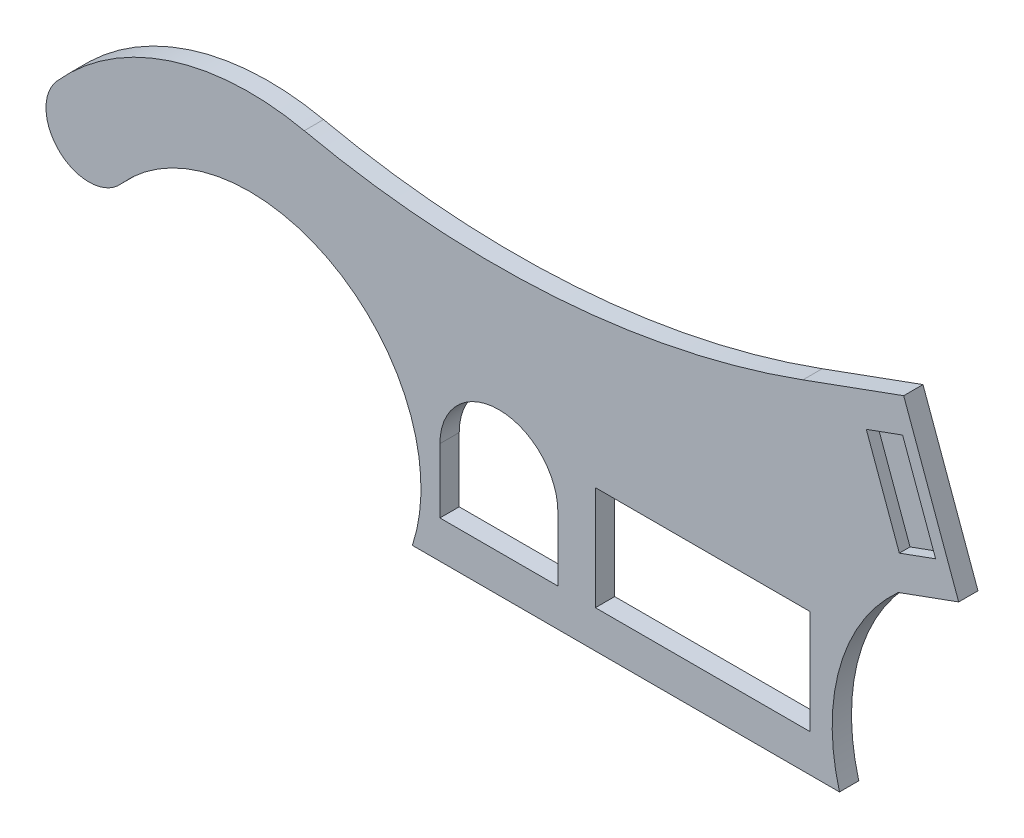
ISO-10303-21;
HEADER;
FILE_DESCRIPTION(('STEP AP214'),'2;1');
FILE_NAME('part.step','',(''),(''),'','','');
FILE_SCHEMA(('AUTOMOTIVE_DESIGN { 1 0 10303 214 1 1 1 1 }'));
ENDSEC;
DATA;
#1=APPLICATION_CONTEXT('core data for automotive mechanical design processes');
#2=APPLICATION_PROTOCOL_DEFINITION('international standard','automotive_design',2000,#1);
#3=PRODUCT_CONTEXT('',#1,'mechanical');
#4=PRODUCT('Part','Part','',(#3));
#5=PRODUCT_RELATED_PRODUCT_CATEGORY('part','',(#4));
#6=PRODUCT_DEFINITION_FORMATION('','',#4);
#7=PRODUCT_DEFINITION_CONTEXT('part definition',#1,'design');
#8=PRODUCT_DEFINITION('design','',#6,#7);
#9=PRODUCT_DEFINITION_SHAPE('','',#8);
#10=(LENGTH_UNIT() NAMED_UNIT(*) SI_UNIT(.MILLI.,.METRE.));
#11=(NAMED_UNIT(*) PLANE_ANGLE_UNIT() SI_UNIT($,.RADIAN.));
#12=(NAMED_UNIT(*) SI_UNIT($,.STERADIAN.) SOLID_ANGLE_UNIT());
#13=UNCERTAINTY_MEASURE_WITH_UNIT(LENGTH_MEASURE(1.E-05),#10,'distance_accuracy_value','');
#14=(GEOMETRIC_REPRESENTATION_CONTEXT(3) GLOBAL_UNCERTAINTY_ASSIGNED_CONTEXT((#13)) GLOBAL_UNIT_ASSIGNED_CONTEXT((#10,
#11,#12)) REPRESENTATION_CONTEXT('',''));
#15=CARTESIAN_POINT('',(0.,0.,0.));
#16=DIRECTION('',(0.,0.,1.));
#17=DIRECTION('',(1.,0.,0.));
#18=AXIS2_PLACEMENT_3D('',#15,#16,#17);
#19=CARTESIAN_POINT('',(0.,0.,18.));
#20=DIRECTION('',(0.342020143325666,-0.939692620785909,0.));
#21=DIRECTION('',(0.93969262078591,0.342020143325666,0.));
#22=AXIS2_PLACEMENT_3D('',#19,#20,#21);
#23=PLANE('',#22);
#24=DIRECTION('',(-0.939692620785909,-0.342020143325666,0.));
#25=VECTOR('',#24,1.);
#26=CARTESIAN_POINT('',(0.,0.,0.));
#27=LINE('',#26,#25);
#28=CARTESIAN_POINT('',(0.,0.,0.));
#29=VERTEX_POINT('',#28);
#30=CARTESIAN_POINT('',(-93.9692620785907,-34.2020143325665,0.));
#31=VERTEX_POINT('',#30);
#32=EDGE_CURVE('E242',#29,#31,#27,.T.);
#33=ORIENTED_EDGE('',*,*,#32,.T.);
#34=DIRECTION('',(0.,0.,-1.));
#35=VECTOR('',#34,1.);
#36=CARTESIAN_POINT('',(-93.9692620785907,-34.2020143325665,18.));
#37=LINE('',#36,#35);
#38=CARTESIAN_POINT('',(-93.9692620785907,-34.2020143325665,18.));
#39=VERTEX_POINT('',#38);
#40=EDGE_CURVE('E11',#39,#31,#37,.T.);
#41=ORIENTED_EDGE('',*,*,#40,.F.);
#42=DIRECTION('',(-0.939692620785909,-0.342020143325666,0.));
#43=VECTOR('',#42,1.);
#44=CARTESIAN_POINT('',(0.,0.,18.));
#45=LINE('',#44,#43);
#46=CARTESIAN_POINT('',(0.,0.,18.));
#47=VERTEX_POINT('',#46);
#48=EDGE_CURVE('E278',#47,#39,#45,.T.);
#49=ORIENTED_EDGE('',*,*,#48,.F.);
#50=DIRECTION('',(0.,0.,-1.));
#51=VECTOR('',#50,1.);
#52=CARTESIAN_POINT('',(0.,0.,18.));
#53=LINE('',#52,#51);
#54=EDGE_CURVE('E298',#47,#29,#53,.T.);
#55=ORIENTED_EDGE('',*,*,#54,.T.);
#56=EDGE_LOOP('',(#33,#41,#49,#55));
#57=FACE_BOUND('',#56,.T.);
#58=ADVANCED_FACE('F35',(#57),#23,.F.);
#59=CARTESIAN_POINT('',(-380.564455781356,753.21180889001,18.));
#60=DIRECTION('',(0.,0.,-1.));
#61=DIRECTION('',(-1.,0.,0.));
#62=AXIS2_PLACEMENT_3D('',#59,#60,#61);
#63=CYLINDRICAL_SURFACE('',#62,837.948288413742);
#64=CARTESIAN_POINT('',(-380.564455781356,753.21180889001,0.));
#65=DIRECTION('',(0.,0.,-1.));
#66=DIRECTION('',(1.,0.,0.));
#67=AXIS2_PLACEMENT_3D('',#64,#65,#66);
#68=CIRCLE('',#67,837.948288413742);
#69=CARTESIAN_POINT('',(-559.0472163884,-65.5074581494367,0.));
#70=VERTEX_POINT('',#69);
#71=EDGE_CURVE('E301',#31,#70,#68,.T.);
#72=ORIENTED_EDGE('',*,*,#71,.T.);
#73=DIRECTION('',(0.,0.,-1.));
#74=VECTOR('',#73,1.);
#75=CARTESIAN_POINT('',(-559.0472163884,-65.5074581494367,18.));
#76=LINE('',#75,#74);
#77=CARTESIAN_POINT('',(-559.0472163884,-65.5074581494367,18.));
#78=VERTEX_POINT('',#77);
#79=EDGE_CURVE('E42',#78,#70,#76,.T.);
#80=ORIENTED_EDGE('',*,*,#79,.F.);
#81=CARTESIAN_POINT('',(-380.564455781356,753.21180889001,18.));
#82=DIRECTION('',(0.,0.,-1.));
#83=DIRECTION('',(1.,0.,0.));
#84=AXIS2_PLACEMENT_3D('',#81,#82,#83);
#85=CIRCLE('',#84,837.948288413742);
#86=EDGE_CURVE('E281',#39,#78,#85,.T.);
#87=ORIENTED_EDGE('',*,*,#86,.F.);
#88=ORIENTED_EDGE('',*,*,#40,.T.);
#89=EDGE_LOOP('',(#72,#80,#87,#88));
#90=FACE_BOUND('',#89,.T.);
#91=ADVANCED_FACE('F363',(#90),#63,.F.);
#92=CARTESIAN_POINT('',(-610.167151995381,-300.,18.));
#93=DIRECTION('',(0.,0.,-1.));
#94=DIRECTION('',(-1.,0.,0.));
#95=AXIS2_PLACEMENT_3D('',#92,#93,#94);
#96=CYLINDRICAL_SURFACE('',#95,240.);
#97=CARTESIAN_POINT('',(-610.167151995381,-300.,0.));
#98=DIRECTION('',(0.,0.,1.));
#99=DIRECTION('',(-1.,0.,0.));
#100=AXIS2_PLACEMENT_3D('',#97,#98,#99);
#101=CIRCLE('',#100,240.);
#102=CARTESIAN_POINT('',(-789.821657990136,-140.864025199264,0.));
#103=VERTEX_POINT('',#102);
#104=EDGE_CURVE('E303',#70,#103,#101,.T.);
#105=ORIENTED_EDGE('',*,*,#104,.T.);
#106=DIRECTION('',(0.,0.,-1.));
#107=VECTOR('',#106,1.);
#108=CARTESIAN_POINT('',(-789.821657990136,-140.864025199264,18.));
#109=LINE('',#108,#107);
#110=CARTESIAN_POINT('',(-789.821657990136,-140.864025199264,18.));
#111=VERTEX_POINT('',#110);
#112=EDGE_CURVE('E333',#111,#103,#109,.T.);
#113=ORIENTED_EDGE('',*,*,#112,.F.);
#114=CARTESIAN_POINT('',(-610.167151995381,-300.,18.));
#115=DIRECTION('',(0.,0.,1.));
#116=DIRECTION('',(-1.,0.,0.));
#117=AXIS2_PLACEMENT_3D('',#114,#115,#116);
#118=CIRCLE('',#117,240.);
#119=EDGE_CURVE('E284',#78,#111,#118,.T.);
#120=ORIENTED_EDGE('',*,*,#119,.F.);
#121=ORIENTED_EDGE('',*,*,#79,.T.);
#122=EDGE_LOOP('',(#105,#113,#120,#121));
#123=FACE_BOUND('',#122,.T.);
#124=ADVANCED_FACE('F340',(#123),#96,.T.);
#125=CARTESIAN_POINT('',(-759.879240324344,-167.386687666053,18.));
#126=DIRECTION('',(0.,0.,-1.));
#127=DIRECTION('',(-1.,0.,0.));
#128=AXIS2_PLACEMENT_3D('',#125,#126,#127);
#129=CYLINDRICAL_SURFACE('',#128,40.);
#130=CARTESIAN_POINT('',(-759.879240324344,-167.386687666053,0.));
#131=DIRECTION('',(0.,0.,1.));
#132=DIRECTION('',(-1.,0.,0.));
#133=AXIS2_PLACEMENT_3D('',#130,#131,#132);
#134=CIRCLE('',#133,40.);
#135=CARTESIAN_POINT('',(-729.936822658551,-193.909350132843,0.));
#136=VERTEX_POINT('',#135);
#137=EDGE_CURVE('E305',#103,#136,#134,.T.);
#138=ORIENTED_EDGE('',*,*,#137,.T.);
#139=DIRECTION('',(0.,0.,-1.));
#140=VECTOR('',#139,1.);
#141=CARTESIAN_POINT('',(-729.936822658551,-193.909350132843,18.));
#142=LINE('',#141,#140);
#143=CARTESIAN_POINT('',(-729.936822658551,-193.909350132843,18.));
#144=VERTEX_POINT('',#143);
#145=EDGE_CURVE('E330',#144,#136,#142,.T.);
#146=ORIENTED_EDGE('',*,*,#145,.F.);
#147=CARTESIAN_POINT('',(-759.879240324344,-167.386687666053,18.));
#148=DIRECTION('',(0.,0.,1.));
#149=DIRECTION('',(-1.,0.,0.));
#150=AXIS2_PLACEMENT_3D('',#147,#148,#149);
#151=CIRCLE('',#150,40.);
#152=EDGE_CURVE('E286',#111,#144,#151,.T.);
#153=ORIENTED_EDGE('',*,*,#152,.F.);
#154=ORIENTED_EDGE('',*,*,#112,.T.);
#155=EDGE_LOOP('',(#138,#146,#153,#154));
#156=FACE_BOUND('',#155,.T.);
#157=ADVANCED_FACE('F351',(#156),#129,.T.);
#158=CARTESIAN_POINT('',(-610.167151995381,-300.,18.));
#159=DIRECTION('',(0.,0.,-1.));
#160=DIRECTION('',(-1.,0.,0.));
#161=AXIS2_PLACEMENT_3D('',#158,#159,#160);
#162=CYLINDRICAL_SURFACE('',#161,160.);
#163=CARTESIAN_POINT('',(-610.167151995381,-300.,0.));
#164=DIRECTION('',(0.,0.,-1.));
#165=DIRECTION('',(1.,0.,0.));
#166=AXIS2_PLACEMENT_3D('',#163,#164,#165);
#167=CIRCLE('',#166,160.);
#168=CARTESIAN_POINT('',(-458.180310459675,-350.,0.));
#169=VERTEX_POINT('',#168);
#170=EDGE_CURVE('E307',#136,#169,#167,.T.);
#171=ORIENTED_EDGE('',*,*,#170,.T.);
#172=DIRECTION('',(0.,0.,-1.));
#173=VECTOR('',#172,1.);
#174=CARTESIAN_POINT('',(-458.180310459675,-350.,18.));
#175=LINE('',#174,#173);
#176=CARTESIAN_POINT('',(-458.180310459675,-350.,18.));
#177=VERTEX_POINT('',#176);
#178=EDGE_CURVE('E327',#177,#169,#175,.T.);
#179=ORIENTED_EDGE('',*,*,#178,.F.);
#180=CARTESIAN_POINT('',(-610.167151995381,-300.,18.));
#181=DIRECTION('',(0.,0.,-1.));
#182=DIRECTION('',(1.,0.,0.));
#183=AXIS2_PLACEMENT_3D('',#180,#181,#182);
#184=CIRCLE('',#183,160.);
#185=EDGE_CURVE('E288',#144,#177,#184,.T.);
#186=ORIENTED_EDGE('',*,*,#185,.F.);
#187=ORIENTED_EDGE('',*,*,#145,.T.);
#188=EDGE_LOOP('',(#171,#179,#186,#187));
#189=FACE_BOUND('',#188,.T.);
#190=ADVANCED_FACE('F355',(#189),#162,.F.);
#191=CARTESIAN_POINT('',(-458.180310459675,-350.,18.));
#192=DIRECTION('',(0.,1.,0.));
#193=DIRECTION('',(-1.,0.,0.));
#194=AXIS2_PLACEMENT_3D('',#191,#192,#193);
#195=PLANE('',#194);
#196=DIRECTION('',(1.,0.,0.));
#197=VECTOR('',#196,1.);
#198=CARTESIAN_POINT('',(-458.180310459675,-350.,0.));
#199=LINE('',#198,#197);
#200=CARTESIAN_POINT('',(-59.8669050148762,-350.,0.));
#201=VERTEX_POINT('',#200);
#202=EDGE_CURVE('E309',#169,#201,#199,.T.);
#203=ORIENTED_EDGE('',*,*,#202,.T.);
#204=DIRECTION('',(0.,0.,-1.));
#205=VECTOR('',#204,1.);
#206=CARTESIAN_POINT('',(-59.8669050148762,-350.,18.));
#207=LINE('',#206,#205);
#208=CARTESIAN_POINT('',(-59.8669050148762,-350.,18.));
#209=VERTEX_POINT('',#208);
#210=EDGE_CURVE('E324',#209,#201,#207,.T.);
#211=ORIENTED_EDGE('',*,*,#210,.F.);
#212=DIRECTION('',(1.,0.,0.));
#213=VECTOR('',#212,1.);
#214=CARTESIAN_POINT('',(-458.180310459675,-350.,18.));
#215=LINE('',#214,#213);
#216=EDGE_CURVE('E290',#177,#209,#215,.T.);
#217=ORIENTED_EDGE('',*,*,#216,.F.);
#218=ORIENTED_EDGE('',*,*,#178,.T.);
#219=EDGE_LOOP('',(#203,#211,#217,#218));
#220=FACE_BOUND('',#219,.T.);
#221=ADVANCED_FACE('F381',(#220),#195,.F.);
#222=CARTESIAN_POINT('',(119.832848004619,-300.,18.));
#223=DIRECTION('',(0.,0.,-1.));
#224=DIRECTION('',(-1.,0.,0.));
#225=AXIS2_PLACEMENT_3D('',#222,#223,#224);
#226=CYLINDRICAL_SURFACE('',#225,186.52614088987);
#227=CARTESIAN_POINT('',(119.832848004619,-300.,0.));
#228=DIRECTION('',(0.,0.,-1.));
#229=DIRECTION('',(-1.,0.,0.));
#230=AXIS2_PLACEMENT_3D('',#227,#228,#229);
#231=CIRCLE('',#230,186.52614088987);
#232=CARTESIAN_POINT('',(-5.07853574830464,-161.475101717426,0.));
#233=VERTEX_POINT('',#232);
#234=EDGE_CURVE('E311',#201,#233,#231,.T.);
#235=ORIENTED_EDGE('',*,*,#234,.T.);
#236=DIRECTION('',(0.,0.,-1.));
#237=VECTOR('',#236,1.);
#238=CARTESIAN_POINT('',(-5.07853574830464,-161.475101717426,18.));
#239=LINE('',#238,#237);
#240=CARTESIAN_POINT('',(-5.07853574830464,-161.475101717426,18.));
#241=VERTEX_POINT('',#240);
#242=EDGE_CURVE('E321',#241,#233,#239,.T.);
#243=ORIENTED_EDGE('',*,*,#242,.F.);
#244=CARTESIAN_POINT('',(119.832848004619,-300.,18.));
#245=DIRECTION('',(0.,0.,-1.));
#246=DIRECTION('',(-1.,0.,0.));
#247=AXIS2_PLACEMENT_3D('',#244,#245,#246);
#248=CIRCLE('',#247,186.52614088987);
#249=EDGE_CURVE('E292',#209,#241,#248,.T.);
#250=ORIENTED_EDGE('',*,*,#249,.F.);
#251=ORIENTED_EDGE('',*,*,#210,.T.);
#252=EDGE_LOOP('',(#235,#243,#250,#251));
#253=FACE_BOUND('',#252,.T.);
#254=ADVANCED_FACE('F379',(#253),#226,.F.);
#255=CARTESIAN_POINT('',(51.3030214988499,-140.953893117886,18.));
#256=DIRECTION('',(-0.342020143325666,0.939692620785909,0.));
#257=DIRECTION('',(-0.939692620785909,-0.342020143325666,0.));
#258=AXIS2_PLACEMENT_3D('',#255,#256,#257);
#259=PLANE('',#258);
#260=DIRECTION('',(0.939692620785909,0.342020143325666,0.));
#261=VECTOR('',#260,1.);
#262=CARTESIAN_POINT('',(51.3030214988499,-140.953893117886,0.));
#263=LINE('',#262,#261);
#264=CARTESIAN_POINT('',(51.3030214988499,-140.953893117886,0.));
#265=VERTEX_POINT('',#264);
#266=EDGE_CURVE('E313',#233,#265,#263,.T.);
#267=ORIENTED_EDGE('',*,*,#266,.T.);
#268=DIRECTION('',(0.,0.,-1.));
#269=VECTOR('',#268,1.);
#270=CARTESIAN_POINT('',(51.3030214988499,-140.953893117886,18.));
#271=LINE('',#270,#269);
#272=CARTESIAN_POINT('',(51.3030214988499,-140.953893117886,18.));
#273=VERTEX_POINT('',#272);
#274=EDGE_CURVE('E318',#273,#265,#271,.T.);
#275=ORIENTED_EDGE('',*,*,#274,.F.);
#276=DIRECTION('',(0.939692620785909,0.342020143325666,0.));
#277=VECTOR('',#276,1.);
#278=CARTESIAN_POINT('',(51.3030214988499,-140.953893117886,18.));
#279=LINE('',#278,#277);
#280=EDGE_CURVE('E294',#241,#273,#279,.T.);
#281=ORIENTED_EDGE('',*,*,#280,.F.);
#282=ORIENTED_EDGE('',*,*,#242,.T.);
#283=EDGE_LOOP('',(#267,#275,#281,#282));
#284=FACE_BOUND('',#283,.T.);
#285=ADVANCED_FACE('F375',(#284),#259,.F.);
#286=CARTESIAN_POINT('',(0.,0.,18.));
#287=DIRECTION('',(-0.939692620785909,-0.342020143325666,0.));
#288=DIRECTION('',(0.342020143325666,-0.93969262078591,0.));
#289=AXIS2_PLACEMENT_3D('',#286,#287,#288);
#290=PLANE('',#289);
#291=DIRECTION('',(-0.342020143325666,0.939692620785909,0.));
#292=VECTOR('',#291,1.);
#293=CARTESIAN_POINT('',(0.,0.,0.));
#294=LINE('',#293,#292);
#295=EDGE_CURVE('E282',#265,#29,#294,.T.);
#296=ORIENTED_EDGE('',*,*,#295,.T.);
#297=ORIENTED_EDGE('',*,*,#54,.F.);
#298=DIRECTION('',(-0.342020143325666,0.939692620785909,0.));
#299=VECTOR('',#298,1.);
#300=CARTESIAN_POINT('',(0.,0.,18.));
#301=LINE('',#300,#299);
#302=EDGE_CURVE('E296',#273,#47,#301,.T.);
#303=ORIENTED_EDGE('',*,*,#302,.F.);
#304=ORIENTED_EDGE('',*,*,#274,.T.);
#305=EDGE_LOOP('',(#296,#297,#303,#304));
#306=FACE_BOUND('',#305,.T.);
#307=ADVANCED_FACE('F370',(#306),#290,.F.);
#308=CARTESIAN_POINT('',(-380.564455781356,753.21180889001,18.));
#309=DIRECTION('',(0.,0.,1.));
#310=DIRECTION('',(1.,0.,0.));
#311=AXIS2_PLACEMENT_3D('',#308,#309,#310);
#312=PLANE('',#311);
#313=DIRECTION('',(-0.939692620785909,-0.342020143325666,0.));
#314=VECTOR('',#313,1.);
#315=CARTESIAN_POINT('',(-1.01570714966093,-32.2950203434853,18.));
#316=LINE('',#315,#314);
#317=CARTESIAN_POINT('',(-1.01570714966093,-32.2950203434853,18.));
#318=VERTEX_POINT('',#317);
#319=CARTESIAN_POINT('',(-34.8446414979536,-44.6077455032092,18.));
#320=VERTEX_POINT('',#319);
#321=EDGE_CURVE('E49',#318,#320,#316,.T.);
#322=ORIENTED_EDGE('',*,*,#321,.F.);
#323=DIRECTION('',(-0.342020143325666,0.939692620785909,0.));
#324=VECTOR('',#323,1.);
#325=CARTESIAN_POINT('',(-1.01570714966093,-32.2950203434853,18.));
#326=LINE('',#325,#324);
#327=CARTESIAN_POINT('',(29.766105749649,-116.867356214217,18.));
#328=VERTEX_POINT('',#327);
#329=EDGE_CURVE('E197',#328,#318,#326,.T.);
#330=ORIENTED_EDGE('',*,*,#329,.F.);
#331=DIRECTION('',(0.939692620785909,0.342020143325666,0.));
#332=VECTOR('',#331,1.);
#333=CARTESIAN_POINT('',(29.766105749649,-116.867356214217,18.));
#334=LINE('',#333,#332);
#335=CARTESIAN_POINT('',(-4.06282859864369,-129.180081373941,18.));
#336=VERTEX_POINT('',#335);
#337=EDGE_CURVE('E200',#336,#328,#334,.T.);
#338=ORIENTED_EDGE('',*,*,#337,.F.);
#339=DIRECTION('',(0.342020143325666,-0.939692620785909,0.));
#340=VECTOR('',#339,1.);
#341=CARTESIAN_POINT('',(-34.8446414979536,-44.6077455032092,18.));
#342=LINE('',#341,#340);
#343=EDGE_CURVE('E206',#320,#336,#342,.T.);
#344=ORIENTED_EDGE('',*,*,#343,.F.);
#345=EDGE_LOOP('',(#322,#330,#338,#344));
#346=FACE_BOUND('',#345,.T.);
#347=DIRECTION('',(0.,1.,0.));
#348=VECTOR('',#347,1.);
#349=CARTESIAN_POINT('',(-87.5083122360586,-315.,18.));
#350=LINE('',#349,#348);
#351=CARTESIAN_POINT('',(-87.5083122360586,-315.,18.));
#352=VERTEX_POINT('',#351);
#353=CARTESIAN_POINT('',(-87.5083122360586,-218.,18.));
#354=VERTEX_POINT('',#353);
#355=EDGE_CURVE('E57',#352,#354,#350,.T.);
#356=ORIENTED_EDGE('',*,*,#355,.F.);
#357=DIRECTION('',(1.,0.,0.));
#358=VECTOR('',#357,1.);
#359=CARTESIAN_POINT('',(-287.508312236059,-315.,18.));
#360=LINE('',#359,#358);
#361=CARTESIAN_POINT('',(-287.508312236059,-315.,18.));
#362=VERTEX_POINT('',#361);
#363=EDGE_CURVE('E220',#362,#352,#360,.T.);
#364=ORIENTED_EDGE('',*,*,#363,.F.);
#365=DIRECTION('',(0.,-1.,0.));
#366=VECTOR('',#365,1.);
#367=CARTESIAN_POINT('',(-287.508312236059,-315.,18.));
#368=LINE('',#367,#366);
#369=CARTESIAN_POINT('',(-287.508312236059,-218.,18.));
#370=VERTEX_POINT('',#369);
#371=EDGE_CURVE('E235',#370,#362,#368,.T.);
#372=ORIENTED_EDGE('',*,*,#371,.F.);
#373=DIRECTION('',(-1.,0.,0.));
#374=VECTOR('',#373,1.);
#375=CARTESIAN_POINT('',(-287.508312236059,-218.,18.));
#376=LINE('',#375,#374);
#377=EDGE_CURVE('E231',#354,#370,#376,.T.);
#378=ORIENTED_EDGE('',*,*,#377,.F.);
#379=EDGE_LOOP('',(#356,#364,#372,#378));
#380=FACE_BOUND('',#379,.T.);
#381=CARTESIAN_POINT('',(-377.508312236059,-255.,18.));
#382=DIRECTION('',(0.,0.,1.));
#383=DIRECTION('',(-1.,0.,0.));
#384=AXIS2_PLACEMENT_3D('',#381,#382,#383);
#385=CIRCLE('',#384,55.);
#386=CARTESIAN_POINT('',(-322.508312236059,-255.,18.));
#387=VERTEX_POINT('',#386);
#388=CARTESIAN_POINT('',(-432.508312236059,-255.,18.));
#389=VERTEX_POINT('',#388);
#390=EDGE_CURVE('E212',#387,#389,#385,.T.);
#391=ORIENTED_EDGE('',*,*,#390,.F.);
#392=DIRECTION('',(0.,1.,0.));
#393=VECTOR('',#392,1.);
#394=CARTESIAN_POINT('',(-322.508312236059,-315.,18.));
#395=LINE('',#394,#393);
#396=CARTESIAN_POINT('',(-322.508312236059,-315.,18.));
#397=VERTEX_POINT('',#396);
#398=EDGE_CURVE('E252',#397,#387,#395,.T.);
#399=ORIENTED_EDGE('',*,*,#398,.F.);
#400=DIRECTION('',(1.,0.,0.));
#401=VECTOR('',#400,1.);
#402=CARTESIAN_POINT('',(-322.508312236059,-315.,18.));
#403=LINE('',#402,#401);
#404=CARTESIAN_POINT('',(-432.508312236059,-315.,18.));
#405=VERTEX_POINT('',#404);
#406=EDGE_CURVE('E266',#405,#397,#403,.T.);
#407=ORIENTED_EDGE('',*,*,#406,.F.);
#408=DIRECTION('',(0.,-1.,0.));
#409=VECTOR('',#408,1.);
#410=CARTESIAN_POINT('',(-432.508312236059,-315.,18.));
#411=LINE('',#410,#409);
#412=EDGE_CURVE('E263',#389,#405,#411,.T.);
#413=ORIENTED_EDGE('',*,*,#412,.F.);
#414=EDGE_LOOP('',(#391,#399,#407,#413));
#415=FACE_BOUND('',#414,.T.);
#416=ORIENTED_EDGE('',*,*,#48,.T.);
#417=ORIENTED_EDGE('',*,*,#86,.T.);
#418=ORIENTED_EDGE('',*,*,#119,.T.);
#419=ORIENTED_EDGE('',*,*,#152,.T.);
#420=ORIENTED_EDGE('',*,*,#185,.T.);
#421=ORIENTED_EDGE('',*,*,#216,.T.);
#422=ORIENTED_EDGE('',*,*,#249,.T.);
#423=ORIENTED_EDGE('',*,*,#280,.T.);
#424=ORIENTED_EDGE('',*,*,#302,.T.);
#425=EDGE_LOOP('',(#416,#417,#418,#419,#420,#421,#422,#423,#424));
#426=FACE_BOUND('',#425,.T.);
#427=ADVANCED_FACE('F359',(#346,#380,#415,#426),#312,.T.);
#428=CARTESIAN_POINT('',(-380.564455781356,753.21180889001,0.));
#429=DIRECTION('',(0.,0.,1.));
#430=DIRECTION('',(1.,0.,0.));
#431=AXIS2_PLACEMENT_3D('',#428,#429,#430);
#432=PLANE('',#431);
#433=DIRECTION('',(1.,0.,0.));
#434=VECTOR('',#433,1.);
#435=CARTESIAN_POINT('',(-287.508312236059,-315.,0.));
#436=LINE('',#435,#434);
#437=CARTESIAN_POINT('',(-287.508312236059,-315.,0.));
#438=VERTEX_POINT('',#437);
#439=CARTESIAN_POINT('',(-87.5083122360586,-315.,0.));
#440=VERTEX_POINT('',#439);
#441=EDGE_CURVE('E226',#438,#440,#436,.T.);
#442=ORIENTED_EDGE('',*,*,#441,.T.);
#443=DIRECTION('',(0.,1.,0.));
#444=VECTOR('',#443,1.);
#445=CARTESIAN_POINT('',(-87.5083122360586,-315.,0.));
#446=LINE('',#445,#444);
#447=CARTESIAN_POINT('',(-87.5083122360586,-218.,0.));
#448=VERTEX_POINT('',#447);
#449=EDGE_CURVE('E216',#440,#448,#446,.T.);
#450=ORIENTED_EDGE('',*,*,#449,.T.);
#451=DIRECTION('',(-1.,0.,0.));
#452=VECTOR('',#451,1.);
#453=CARTESIAN_POINT('',(-287.508312236059,-218.,0.));
#454=LINE('',#453,#452);
#455=CARTESIAN_POINT('',(-287.508312236059,-218.,0.));
#456=VERTEX_POINT('',#455);
#457=EDGE_CURVE('E219',#448,#456,#454,.T.);
#458=ORIENTED_EDGE('',*,*,#457,.T.);
#459=DIRECTION('',(0.,-1.,0.));
#460=VECTOR('',#459,1.);
#461=CARTESIAN_POINT('',(-287.508312236059,-315.,0.));
#462=LINE('',#461,#460);
#463=EDGE_CURVE('E223',#456,#438,#462,.T.);
#464=ORIENTED_EDGE('',*,*,#463,.T.);
#465=EDGE_LOOP('',(#442,#450,#458,#464));
#466=FACE_BOUND('',#465,.T.);
#467=DIRECTION('',(0.,1.,0.));
#468=VECTOR('',#467,1.);
#469=CARTESIAN_POINT('',(-322.508312236059,-315.,0.));
#470=LINE('',#469,#468);
#471=CARTESIAN_POINT('',(-322.508312236059,-315.,0.));
#472=VERTEX_POINT('',#471);
#473=CARTESIAN_POINT('',(-322.508312236059,-255.,0.));
#474=VERTEX_POINT('',#473);
#475=EDGE_CURVE('E258',#472,#474,#470,.T.);
#476=ORIENTED_EDGE('',*,*,#475,.T.);
#477=CARTESIAN_POINT('',(-377.508312236059,-255.,0.));
#478=DIRECTION('',(0.,0.,1.));
#479=DIRECTION('',(-1.,0.,0.));
#480=AXIS2_PLACEMENT_3D('',#477,#478,#479);
#481=CIRCLE('',#480,55.);
#482=CARTESIAN_POINT('',(-432.508312236059,-255.,0.));
#483=VERTEX_POINT('',#482);
#484=EDGE_CURVE('E248',#474,#483,#481,.T.);
#485=ORIENTED_EDGE('',*,*,#484,.T.);
#486=DIRECTION('',(0.,-1.,0.));
#487=VECTOR('',#486,1.);
#488=CARTESIAN_POINT('',(-432.508312236059,-315.,0.));
#489=LINE('',#488,#487);
#490=CARTESIAN_POINT('',(-432.508312236059,-315.,0.));
#491=VERTEX_POINT('',#490);
#492=EDGE_CURVE('E251',#483,#491,#489,.T.);
#493=ORIENTED_EDGE('',*,*,#492,.T.);
#494=DIRECTION('',(1.,0.,0.));
#495=VECTOR('',#494,1.);
#496=CARTESIAN_POINT('',(-322.508312236059,-315.,0.));
#497=LINE('',#496,#495);
#498=EDGE_CURVE('E255',#491,#472,#497,.T.);
#499=ORIENTED_EDGE('',*,*,#498,.T.);
#500=EDGE_LOOP('',(#476,#485,#493,#499));
#501=FACE_BOUND('',#500,.T.);
#502=ORIENTED_EDGE('',*,*,#32,.F.);
#503=ORIENTED_EDGE('',*,*,#295,.F.);
#504=ORIENTED_EDGE('',*,*,#266,.F.);
#505=ORIENTED_EDGE('',*,*,#234,.F.);
#506=ORIENTED_EDGE('',*,*,#202,.F.);
#507=ORIENTED_EDGE('',*,*,#170,.F.);
#508=ORIENTED_EDGE('',*,*,#137,.F.);
#509=ORIENTED_EDGE('',*,*,#104,.F.);
#510=ORIENTED_EDGE('',*,*,#71,.F.);
#511=EDGE_LOOP('',(#502,#503,#504,#505,#506,#507,#508,#509,#510));
#512=FACE_BOUND('',#511,.T.);
#513=ADVANCED_FACE('F346',(#466,#501,#512),#432,.F.);
#514=CARTESIAN_POINT('',(-377.508312236059,-255.,0.));
#515=DIRECTION('',(0.,0.,1.));
#516=DIRECTION('',(1.,0.,0.));
#517=AXIS2_PLACEMENT_3D('',#514,#515,#516);
#518=CYLINDRICAL_SURFACE('',#517,55.);
#519=ORIENTED_EDGE('',*,*,#390,.T.);
#520=DIRECTION('',(0.,0.,1.));
#521=VECTOR('',#520,1.);
#522=CARTESIAN_POINT('',(-432.508312236059,-255.,0.));
#523=LINE('',#522,#521);
#524=EDGE_CURVE('E261',#483,#389,#523,.T.);
#525=ORIENTED_EDGE('',*,*,#524,.F.);
#526=ORIENTED_EDGE('',*,*,#484,.F.);
#527=DIRECTION('',(0.,0.,1.));
#528=VECTOR('',#527,1.);
#529=CARTESIAN_POINT('',(-322.508312236059,-255.,0.));
#530=LINE('',#529,#528);
#531=EDGE_CURVE('E232',#474,#387,#530,.T.);
#532=ORIENTED_EDGE('',*,*,#531,.T.);
#533=EDGE_LOOP('',(#519,#525,#526,#532));
#534=FACE_BOUND('',#533,.T.);
#535=ADVANCED_FACE('F445',(#534),#518,.F.);
#536=CARTESIAN_POINT('',(-322.508312236059,-315.,0.));
#537=DIRECTION('',(1.,0.,0.));
#538=DIRECTION('',(0.,0.,-1.));
#539=AXIS2_PLACEMENT_3D('',#536,#537,#538);
#540=PLANE('',#539);
#541=ORIENTED_EDGE('',*,*,#398,.T.);
#542=ORIENTED_EDGE('',*,*,#531,.F.);
#543=ORIENTED_EDGE('',*,*,#475,.F.);
#544=DIRECTION('',(0.,0.,1.));
#545=VECTOR('',#544,1.);
#546=CARTESIAN_POINT('',(-322.508312236059,-315.,0.));
#547=LINE('',#546,#545);
#548=EDGE_CURVE('E272',#472,#397,#547,.T.);
#549=ORIENTED_EDGE('',*,*,#548,.T.);
#550=EDGE_LOOP('',(#541,#542,#543,#549));
#551=FACE_BOUND('',#550,.T.);
#552=ADVANCED_FACE('F455',(#551),#540,.F.);
#553=CARTESIAN_POINT('',(-322.508312236059,-315.,0.));
#554=DIRECTION('',(0.,-1.,0.));
#555=DIRECTION('',(0.,0.,-1.));
#556=AXIS2_PLACEMENT_3D('',#553,#554,#555);
#557=PLANE('',#556);
#558=ORIENTED_EDGE('',*,*,#406,.T.);
#559=ORIENTED_EDGE('',*,*,#548,.F.);
#560=ORIENTED_EDGE('',*,*,#498,.F.);
#561=DIRECTION('',(0.,0.,1.));
#562=VECTOR('',#561,1.);
#563=CARTESIAN_POINT('',(-432.508312236059,-315.,0.));
#564=LINE('',#563,#562);
#565=EDGE_CURVE('E274',#491,#405,#564,.T.);
#566=ORIENTED_EDGE('',*,*,#565,.T.);
#567=EDGE_LOOP('',(#558,#559,#560,#566));
#568=FACE_BOUND('',#567,.T.);
#569=ADVANCED_FACE('F465',(#568),#557,.F.);
#570=CARTESIAN_POINT('',(-432.508312236059,-315.,0.));
#571=DIRECTION('',(-1.,0.,0.));
#572=DIRECTION('',(0.,0.,1.));
#573=AXIS2_PLACEMENT_3D('',#570,#571,#572);
#574=PLANE('',#573);
#575=ORIENTED_EDGE('',*,*,#412,.T.);
#576=ORIENTED_EDGE('',*,*,#565,.F.);
#577=ORIENTED_EDGE('',*,*,#492,.F.);
#578=ORIENTED_EDGE('',*,*,#524,.T.);
#579=EDGE_LOOP('',(#575,#576,#577,#578));
#580=FACE_BOUND('',#579,.T.);
#581=ADVANCED_FACE('F475',(#580),#574,.F.);
#582=CARTESIAN_POINT('',(-87.5083122360586,-315.,0.));
#583=DIRECTION('',(1.,0.,0.));
#584=DIRECTION('',(0.,0.,-1.));
#585=AXIS2_PLACEMENT_3D('',#582,#583,#584);
#586=PLANE('',#585);
#587=ORIENTED_EDGE('',*,*,#355,.T.);
#588=DIRECTION('',(0.,0.,1.));
#589=VECTOR('',#588,1.);
#590=CARTESIAN_POINT('',(-87.5083122360586,-218.,0.));
#591=LINE('',#590,#589);
#592=EDGE_CURVE('E229',#448,#354,#591,.T.);
#593=ORIENTED_EDGE('',*,*,#592,.F.);
#594=ORIENTED_EDGE('',*,*,#449,.F.);
#595=DIRECTION('',(0.,0.,1.));
#596=VECTOR('',#595,1.);
#597=CARTESIAN_POINT('',(-87.5083122360586,-315.,0.));
#598=LINE('',#597,#596);
#599=EDGE_CURVE('E240',#440,#352,#598,.T.);
#600=ORIENTED_EDGE('',*,*,#599,.T.);
#601=EDGE_LOOP('',(#587,#593,#594,#600));
#602=FACE_BOUND('',#601,.T.);
#603=ADVANCED_FACE('F485',(#602),#586,.F.);
#604=CARTESIAN_POINT('',(-287.508312236059,-315.,0.));
#605=DIRECTION('',(0.,-1.,0.));
#606=DIRECTION('',(0.,0.,-1.));
#607=AXIS2_PLACEMENT_3D('',#604,#605,#606);
#608=PLANE('',#607);
#609=ORIENTED_EDGE('',*,*,#363,.T.);
#610=ORIENTED_EDGE('',*,*,#599,.F.);
#611=ORIENTED_EDGE('',*,*,#441,.F.);
#612=DIRECTION('',(0.,0.,1.));
#613=VECTOR('',#612,1.);
#614=CARTESIAN_POINT('',(-287.508312236059,-315.,0.));
#615=LINE('',#614,#613);
#616=EDGE_CURVE('E243',#438,#362,#615,.T.);
#617=ORIENTED_EDGE('',*,*,#616,.T.);
#618=EDGE_LOOP('',(#609,#610,#611,#617));
#619=FACE_BOUND('',#618,.T.);
#620=ADVANCED_FACE('F495',(#619),#608,.F.);
#621=CARTESIAN_POINT('',(-287.508312236059,-315.,0.));
#622=DIRECTION('',(-1.,0.,0.));
#623=DIRECTION('',(0.,0.,1.));
#624=AXIS2_PLACEMENT_3D('',#621,#622,#623);
#625=PLANE('',#624);
#626=ORIENTED_EDGE('',*,*,#371,.T.);
#627=ORIENTED_EDGE('',*,*,#616,.F.);
#628=ORIENTED_EDGE('',*,*,#463,.F.);
#629=DIRECTION('',(0.,0.,1.));
#630=VECTOR('',#629,1.);
#631=CARTESIAN_POINT('',(-287.508312236059,-218.,0.));
#632=LINE('',#631,#630);
#633=EDGE_CURVE('E245',#456,#370,#632,.T.);
#634=ORIENTED_EDGE('',*,*,#633,.T.);
#635=EDGE_LOOP('',(#626,#627,#628,#634));
#636=FACE_BOUND('',#635,.T.);
#637=ADVANCED_FACE('F504',(#636),#625,.F.);
#638=CARTESIAN_POINT('',(-287.508312236059,-218.,0.));
#639=DIRECTION('',(0.,1.,0.));
#640=DIRECTION('',(-1.,0.,0.));
#641=AXIS2_PLACEMENT_3D('',#638,#639,#640);
#642=PLANE('',#641);
#643=ORIENTED_EDGE('',*,*,#377,.T.);
#644=ORIENTED_EDGE('',*,*,#633,.F.);
#645=ORIENTED_EDGE('',*,*,#457,.F.);
#646=ORIENTED_EDGE('',*,*,#592,.T.);
#647=EDGE_LOOP('',(#643,#644,#645,#646));
#648=FACE_BOUND('',#647,.T.);
#649=ADVANCED_FACE('F514',(#648),#642,.F.);
#650=CARTESIAN_POINT('',(-1.01570714966093,-32.2950203434853,8.));
#651=DIRECTION('',(-0.342020143325666,0.939692620785909,0.));
#652=DIRECTION('',(-0.939692620785909,-0.342020143325666,0.));
#653=AXIS2_PLACEMENT_3D('',#650,#651,#652);
#654=PLANE('',#653);
#655=ORIENTED_EDGE('',*,*,#321,.T.);
#656=DIRECTION('',(0.,0.,1.));
#657=VECTOR('',#656,1.);
#658=CARTESIAN_POINT('',(-34.8446414979536,-44.6077455032092,8.));
#659=LINE('',#658,#657);
#660=CARTESIAN_POINT('',(-34.8446414979536,-44.6077455032092,8.));
#661=VERTEX_POINT('',#660);
#662=EDGE_CURVE('E175',#661,#320,#659,.T.);
#663=ORIENTED_EDGE('',*,*,#662,.F.);
#664=DIRECTION('',(-0.939692620785909,-0.342020143325666,0.));
#665=VECTOR('',#664,1.);
#666=CARTESIAN_POINT('',(-1.01570714966093,-32.2950203434853,8.));
#667=LINE('',#666,#665);
#668=CARTESIAN_POINT('',(-1.01570714966093,-32.2950203434853,8.));
#669=VERTEX_POINT('',#668);
#670=EDGE_CURVE('E179',#669,#661,#667,.T.);
#671=ORIENTED_EDGE('',*,*,#670,.F.);
#672=DIRECTION('',(0.,0.,1.));
#673=VECTOR('',#672,1.);
#674=CARTESIAN_POINT('',(-1.01570714966093,-32.2950203434853,8.));
#675=LINE('',#674,#673);
#676=EDGE_CURVE('E210',#669,#318,#675,.T.);
#677=ORIENTED_EDGE('',*,*,#676,.T.);
#678=EDGE_LOOP('',(#655,#663,#671,#677));
#679=FACE_BOUND('',#678,.T.);
#680=ADVANCED_FACE('F177',(#679),#654,.F.);
#681=CARTESIAN_POINT('',(-1.01570714966093,-32.2950203434853,8.));
#682=DIRECTION('',(0.939692620785909,0.342020143325666,0.));
#683=DIRECTION('',(-0.342020143325666,0.939692620785909,0.));
#684=AXIS2_PLACEMENT_3D('',#681,#682,#683);
#685=PLANE('',#684);
#686=ORIENTED_EDGE('',*,*,#329,.T.);
#687=ORIENTED_EDGE('',*,*,#676,.F.);
#688=DIRECTION('',(-0.342020143325666,0.939692620785909,0.));
#689=VECTOR('',#688,1.);
#690=CARTESIAN_POINT('',(-1.01570714966093,-32.2950203434853,8.));
#691=LINE('',#690,#689);
#692=CARTESIAN_POINT('',(29.766105749649,-116.867356214217,8.));
#693=VERTEX_POINT('',#692);
#694=EDGE_CURVE('E185',#693,#669,#691,.T.);
#695=ORIENTED_EDGE('',*,*,#694,.F.);
#696=DIRECTION('',(0.,0.,1.));
#697=VECTOR('',#696,1.);
#698=CARTESIAN_POINT('',(29.766105749649,-116.867356214217,8.));
#699=LINE('',#698,#697);
#700=EDGE_CURVE('E213',#693,#328,#699,.T.);
#701=ORIENTED_EDGE('',*,*,#700,.T.);
#702=EDGE_LOOP('',(#686,#687,#695,#701));
#703=FACE_BOUND('',#702,.T.);
#704=ADVANCED_FACE('F538',(#703),#685,.F.);
#705=CARTESIAN_POINT('',(29.766105749649,-116.867356214217,8.));
#706=DIRECTION('',(0.342020143325666,-0.939692620785909,0.));
#707=DIRECTION('',(0.939692620785909,0.342020143325666,0.));
#708=AXIS2_PLACEMENT_3D('',#705,#706,#707);
#709=PLANE('',#708);
#710=ORIENTED_EDGE('',*,*,#337,.T.);
#711=ORIENTED_EDGE('',*,*,#700,.F.);
#712=DIRECTION('',(0.939692620785909,0.342020143325666,0.));
#713=VECTOR('',#712,1.);
#714=CARTESIAN_POINT('',(29.766105749649,-116.867356214217,8.));
#715=LINE('',#714,#713);
#716=CARTESIAN_POINT('',(-4.06282859864369,-129.180081373941,8.));
#717=VERTEX_POINT('',#716);
#718=EDGE_CURVE('E193',#717,#693,#715,.T.);
#719=ORIENTED_EDGE('',*,*,#718,.F.);
#720=DIRECTION('',(0.,0.,1.));
#721=VECTOR('',#720,1.);
#722=CARTESIAN_POINT('',(-4.06282859864369,-129.180081373941,8.));
#723=LINE('',#722,#721);
#724=EDGE_CURVE('E184',#717,#336,#723,.T.);
#725=ORIENTED_EDGE('',*,*,#724,.T.);
#726=EDGE_LOOP('',(#710,#711,#719,#725));
#727=FACE_BOUND('',#726,.T.);
#728=ADVANCED_FACE('F547',(#727),#709,.F.);
#729=CARTESIAN_POINT('',(-34.8446414979536,-44.6077455032092,8.));
#730=DIRECTION('',(-0.939692620785909,-0.342020143325666,0.));
#731=DIRECTION('',(0.342020143325666,-0.939692620785909,0.));
#732=AXIS2_PLACEMENT_3D('',#729,#730,#731);
#733=PLANE('',#732);
#734=ORIENTED_EDGE('',*,*,#343,.T.);
#735=ORIENTED_EDGE('',*,*,#724,.F.);
#736=DIRECTION('',(0.342020143325666,-0.939692620785909,0.));
#737=VECTOR('',#736,1.);
#738=CARTESIAN_POINT('',(-34.8446414979536,-44.6077455032092,8.));
#739=LINE('',#738,#737);
#740=EDGE_CURVE('E188',#661,#717,#739,.T.);
#741=ORIENTED_EDGE('',*,*,#740,.F.);
#742=ORIENTED_EDGE('',*,*,#662,.T.);
#743=EDGE_LOOP('',(#734,#735,#741,#742));
#744=FACE_BOUND('',#743,.T.);
#745=ADVANCED_FACE('F189',(#744),#733,.F.);
#746=CARTESIAN_POINT('',(0.,0.,8.));
#747=DIRECTION('',(0.,0.,1.));
#748=DIRECTION('',(1.,0.,0.));
#749=AXIS2_PLACEMENT_3D('',#746,#747,#748);
#750=PLANE('',#749);
#751=ORIENTED_EDGE('',*,*,#670,.T.);
#752=ORIENTED_EDGE('',*,*,#740,.T.);
#753=ORIENTED_EDGE('',*,*,#718,.T.);
#754=ORIENTED_EDGE('',*,*,#694,.T.);
#755=EDGE_LOOP('',(#751,#752,#753,#754));
#756=FACE_BOUND('',#755,.T.);
#757=ADVANCED_FACE('F195',(#756),#750,.T.);
#758=CLOSED_SHELL('',(#58,#91,#124,#157,#190,#221,#254,#285,#307,#427,#513,#535,#552,#569,#581,
#603,#620,#637,#649,#680,#704,#728,#745,#757));
#759=MANIFOLD_SOLID_BREP('B2',#758);
#760=ADVANCED_BREP_SHAPE_REPRESENTATION('',(#18,#759),#14);
#761=SHAPE_DEFINITION_REPRESENTATION(#9,#760);
ENDSEC;
END-ISO-10303-21;
